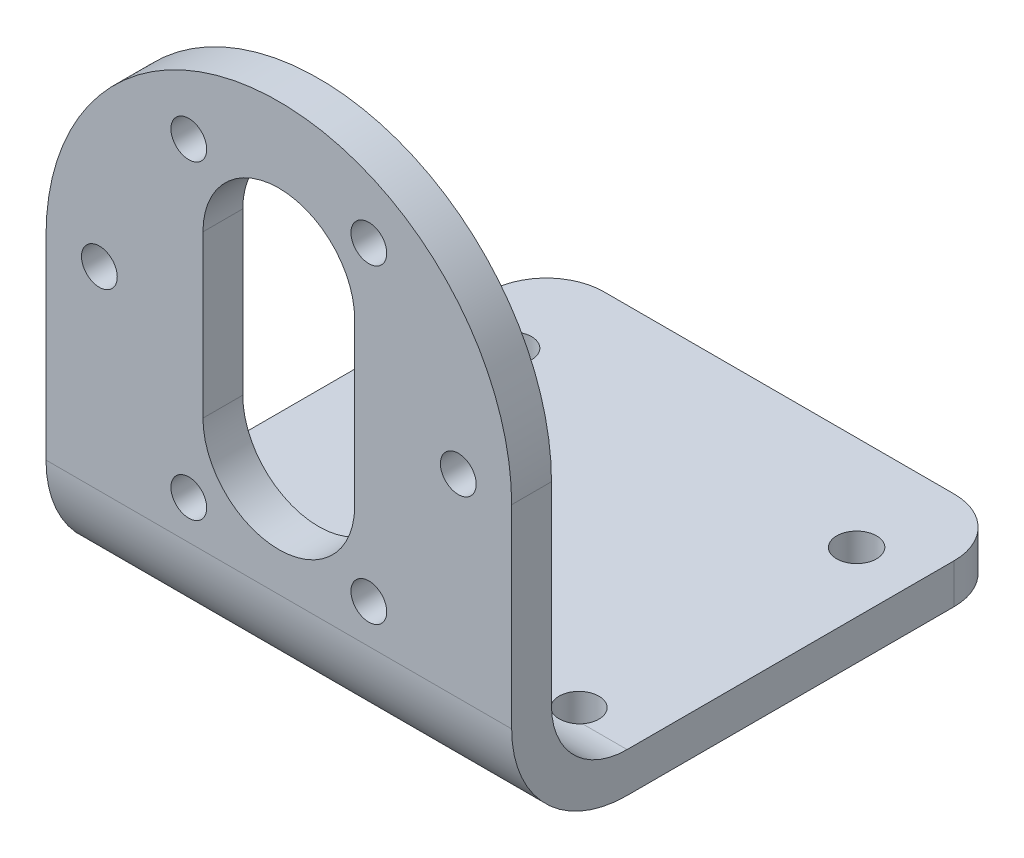
ISO-10303-21;
HEADER;
FILE_DESCRIPTION(('STEP AP214'),'2;1');
FILE_NAME('part.step','',(''),(''),'','','');
FILE_SCHEMA(('AUTOMOTIVE_DESIGN { 1 0 10303 214 1 1 1 1 }'));
ENDSEC;
DATA;
#1=APPLICATION_CONTEXT('core data for automotive mechanical design processes');
#2=APPLICATION_PROTOCOL_DEFINITION('international standard','automotive_design',2000,#1);
#3=PRODUCT_CONTEXT('',#1,'mechanical');
#4=PRODUCT('Part','Part','',(#3));
#5=PRODUCT_RELATED_PRODUCT_CATEGORY('part','',(#4));
#6=PRODUCT_DEFINITION_FORMATION('','',#4);
#7=PRODUCT_DEFINITION_CONTEXT('part definition',#1,'design');
#8=PRODUCT_DEFINITION('design','',#6,#7);
#9=PRODUCT_DEFINITION_SHAPE('','',#8);
#10=(LENGTH_UNIT() NAMED_UNIT(*) SI_UNIT(.MILLI.,.METRE.));
#11=(NAMED_UNIT(*) PLANE_ANGLE_UNIT() SI_UNIT($,.RADIAN.));
#12=(NAMED_UNIT(*) SI_UNIT($,.STERADIAN.) SOLID_ANGLE_UNIT());
#13=UNCERTAINTY_MEASURE_WITH_UNIT(LENGTH_MEASURE(1.E-05),#10,'distance_accuracy_value','');
#14=(GEOMETRIC_REPRESENTATION_CONTEXT(3) GLOBAL_UNCERTAINTY_ASSIGNED_CONTEXT((#13)) GLOBAL_UNIT_ASSIGNED_CONTEXT((#10,
#11,#12)) REPRESENTATION_CONTEXT('',''));
#15=CARTESIAN_POINT('',(0.,0.,0.));
#16=DIRECTION('',(0.,0.,1.));
#17=DIRECTION('',(1.,0.,0.));
#18=AXIS2_PLACEMENT_3D('',#15,#16,#17);
#19=CARTESIAN_POINT('',(-47.1412127925836,47.,50.783023222912));
#20=DIRECTION('',(0.,0.,-1.));
#21=DIRECTION('',(-1.,0.,0.));
#22=AXIS2_PLACEMENT_3D('',#19,#20,#21);
#23=PLANE('',#22);
#24=CARTESIAN_POINT('',(-19.1662127925836,13.3727697016443,50.783023222912));
#25=DIRECTION('',(0.,0.,1.));
#26=DIRECTION('',(1.,0.,0.));
#27=AXIS2_PLACEMENT_3D('',#24,#25,#26);
#28=CIRCLE('',#27,1.55);
#29=CARTESIAN_POINT('',(-17.6162127925836,13.3727697016443,50.783023222912));
#30=VERTEX_POINT('',#29);
#31=EDGE_CURVE('E436',#30,#30,#28,.F.);
#32=ORIENTED_EDGE('',*,*,#31,.T.);
#33=EDGE_LOOP('',(#32));
#34=FACE_BOUND('',#33,.T.);
#35=CARTESIAN_POINT('',(-42.5162127925836,26.825,50.783023222912));
#36=DIRECTION('',(0.,0.,1.));
#37=DIRECTION('',(1.,0.,0.));
#38=AXIS2_PLACEMENT_3D('',#35,#36,#37);
#39=CIRCLE('',#38,1.54999999999999);
#40=CARTESIAN_POINT('',(-40.9662127925836,26.825,50.783023222912));
#41=VERTEX_POINT('',#40);
#42=EDGE_CURVE('E433',#41,#41,#39,.T.);
#43=ORIENTED_EDGE('',*,*,#42,.F.);
#44=EDGE_LOOP('',(#43));
#45=FACE_BOUND('',#44,.T.);
#46=CARTESIAN_POINT('',(-19.1662127925836,40.2772302983557,50.783023222912));
#47=DIRECTION('',(0.,0.,1.));
#48=DIRECTION('',(1.,0.,0.));
#49=AXIS2_PLACEMENT_3D('',#46,#47,#48);
#50=CIRCLE('',#49,1.55);
#51=CARTESIAN_POINT('',(-17.6162127925836,40.2772302983557,50.783023222912));
#52=VERTEX_POINT('',#51);
#53=EDGE_CURVE('E428',#52,#52,#50,.T.);
#54=ORIENTED_EDGE('',*,*,#53,.F.);
#55=EDGE_LOOP('',(#54));
#56=FACE_BOUND('',#55,.T.);
#57=CARTESIAN_POINT('',(-34.7662127925836,13.3727697016443,50.783023222912));
#58=DIRECTION('',(0.,0.,1.));
#59=DIRECTION('',(1.,0.,0.));
#60=AXIS2_PLACEMENT_3D('',#57,#58,#59);
#61=CIRCLE('',#60,1.55);
#62=CARTESIAN_POINT('',(-33.2162127925836,13.3727697016443,50.783023222912));
#63=VERTEX_POINT('',#62);
#64=EDGE_CURVE('E266',#63,#63,#61,.F.);
#65=ORIENTED_EDGE('',*,*,#64,.T.);
#66=EDGE_LOOP('',(#65));
#67=FACE_BOUND('',#66,.T.);
#68=CARTESIAN_POINT('',(-26.9662127925836,19.945,50.783023222912));
#69=DIRECTION('',(0.,0.,1.));
#70=DIRECTION('',(1.,0.,0.));
#71=AXIS2_PLACEMENT_3D('',#68,#69,#70);
#72=CIRCLE('',#71,6.575);
#73=CARTESIAN_POINT('',(-33.5412127925836,19.945,50.783023222912));
#74=VERTEX_POINT('',#73);
#75=CARTESIAN_POINT('',(-20.3912127925836,19.945,50.783023222912));
#76=VERTEX_POINT('',#75);
#77=EDGE_CURVE('E173',#74,#76,#72,.T.);
#78=ORIENTED_EDGE('',*,*,#77,.F.);
#79=DIRECTION('',(0.,-1.,0.));
#80=VECTOR('',#79,1.);
#81=CARTESIAN_POINT('',(-33.5412127925836,0.,50.783023222912));
#82=LINE('',#81,#80);
#83=CARTESIAN_POINT('',(-33.5412127925836,33.925,50.783023222912));
#84=VERTEX_POINT('',#83);
#85=EDGE_CURVE('E51',#84,#74,#82,.T.);
#86=ORIENTED_EDGE('',*,*,#85,.F.);
#87=CARTESIAN_POINT('',(-26.9662127925836,33.925,50.783023222912));
#88=DIRECTION('',(0.,0.,1.));
#89=DIRECTION('',(1.,0.,0.));
#90=AXIS2_PLACEMENT_3D('',#87,#88,#89);
#91=CIRCLE('',#90,6.57500000000001);
#92=CARTESIAN_POINT('',(-20.3912127925836,33.925,50.783023222912));
#93=VERTEX_POINT('',#92);
#94=EDGE_CURVE('E179',#93,#84,#91,.T.);
#95=ORIENTED_EDGE('',*,*,#94,.F.);
#96=DIRECTION('',(0.,-1.,0.));
#97=VECTOR('',#96,1.);
#98=CARTESIAN_POINT('',(-20.3912127925836,0.,50.783023222912));
#99=LINE('',#98,#97);
#100=EDGE_CURVE('E164',#93,#76,#99,.T.);
#101=ORIENTED_EDGE('',*,*,#100,.T.);
#102=EDGE_LOOP('',(#78,#86,#95,#101));
#103=FACE_BOUND('',#102,.T.);
#104=DIRECTION('',(0.,-1.,0.));
#105=VECTOR('',#104,1.);
#106=CARTESIAN_POINT('',(-47.1412127925836,47.,50.783023222912));
#107=LINE('',#106,#105);
#108=CARTESIAN_POINT('',(-47.1412127925836,26.825,50.783023222912));
#109=VERTEX_POINT('',#108);
#110=CARTESIAN_POINT('',(-47.1412127925836,10.,50.783023222912));
#111=VERTEX_POINT('',#110);
#112=EDGE_CURVE('E324',#109,#111,#107,.T.);
#113=ORIENTED_EDGE('',*,*,#112,.T.);
#114=DIRECTION('',(1.,0.,0.));
#115=VECTOR('',#114,1.);
#116=CARTESIAN_POINT('',(-47.1412127925836,10.,50.783023222912));
#117=LINE('',#116,#115);
#118=CARTESIAN_POINT('',(-6.79121279258359,10.,50.783023222912));
#119=VERTEX_POINT('',#118);
#120=EDGE_CURVE('E319',#111,#119,#117,.T.);
#121=ORIENTED_EDGE('',*,*,#120,.T.);
#122=DIRECTION('',(0.,-1.,0.));
#123=VECTOR('',#122,1.);
#124=CARTESIAN_POINT('',(-6.79121279258359,47.,50.783023222912));
#125=LINE('',#124,#123);
#126=CARTESIAN_POINT('',(-6.79121279258359,26.825,50.783023222912));
#127=VERTEX_POINT('',#126);
#128=EDGE_CURVE('E327',#127,#119,#125,.T.);
#129=ORIENTED_EDGE('',*,*,#128,.F.);
#130=CARTESIAN_POINT('',(-26.9662127925836,26.825,50.783023222912));
#131=DIRECTION('',(0.,0.,1.));
#132=DIRECTION('',(1.,0.,0.));
#133=AXIS2_PLACEMENT_3D('',#130,#131,#132);
#134=CIRCLE('',#133,20.175);
#135=EDGE_CURVE('E341',#127,#109,#134,.T.);
#136=ORIENTED_EDGE('',*,*,#135,.T.);
#137=EDGE_LOOP('',(#113,#121,#129,#136));
#138=FACE_BOUND('',#137,.T.);
#139=CARTESIAN_POINT('',(-34.7662127925836,40.2772302983557,50.783023222912));
#140=DIRECTION('',(0.,0.,1.));
#141=DIRECTION('',(1.,0.,0.));
#142=AXIS2_PLACEMENT_3D('',#139,#140,#141);
#143=CIRCLE('',#142,1.55);
#144=CARTESIAN_POINT('',(-33.2162127925836,40.2772302983557,50.783023222912));
#145=VERTEX_POINT('',#144);
#146=EDGE_CURVE('E430',#145,#145,#143,.T.);
#147=ORIENTED_EDGE('',*,*,#146,.F.);
#148=EDGE_LOOP('',(#147));
#149=FACE_BOUND('',#148,.T.);
#150=CARTESIAN_POINT('',(-11.4162127925836,26.825,50.783023222912));
#151=DIRECTION('',(0.,0.,1.));
#152=DIRECTION('',(1.,0.,0.));
#153=AXIS2_PLACEMENT_3D('',#150,#151,#152);
#154=CIRCLE('',#153,1.55);
#155=CARTESIAN_POINT('',(-9.8662127925836,26.825,50.783023222912));
#156=VERTEX_POINT('',#155);
#157=EDGE_CURVE('E439',#156,#156,#154,.T.);
#158=ORIENTED_EDGE('',*,*,#157,.F.);
#159=EDGE_LOOP('',(#158));
#160=FACE_BOUND('',#159,.T.);
#161=ADVANCED_FACE('F34',(#34,#45,#56,#67,#103,#138,#149,#160),#23,.F.);
#162=CARTESIAN_POINT('',(54.8587872074164,0.,47.3330232229119));
#163=DIRECTION('',(0.,0.,1.));
#164=DIRECTION('',(1.,0.,0.));
#165=AXIS2_PLACEMENT_3D('',#162,#163,#164);
#166=PLANE('',#165);
#167=CARTESIAN_POINT('',(-19.1662127925836,13.3727697016443,47.333023222912));
#168=DIRECTION('',(0.,0.,1.));
#169=DIRECTION('',(1.,0.,0.));
#170=AXIS2_PLACEMENT_3D('',#167,#168,#169);
#171=CIRCLE('',#170,1.55);
#172=CARTESIAN_POINT('',(-17.6162127925836,13.3727697016443,47.333023222912));
#173=VERTEX_POINT('',#172);
#174=EDGE_CURVE('E38',#173,#173,#171,.F.);
#175=ORIENTED_EDGE('',*,*,#174,.F.);
#176=EDGE_LOOP('',(#175));
#177=FACE_BOUND('',#176,.T.);
#178=CARTESIAN_POINT('',(-42.5162127925836,26.825,47.333023222912));
#179=DIRECTION('',(0.,0.,1.));
#180=DIRECTION('',(1.,0.,0.));
#181=AXIS2_PLACEMENT_3D('',#178,#179,#180);
#182=CIRCLE('',#181,1.54999999999999);
#183=CARTESIAN_POINT('',(-40.9662127925836,26.825,47.333023222912));
#184=VERTEX_POINT('',#183);
#185=EDGE_CURVE('E239',#184,#184,#182,.T.);
#186=ORIENTED_EDGE('',*,*,#185,.T.);
#187=EDGE_LOOP('',(#186));
#188=FACE_BOUND('',#187,.T.);
#189=CARTESIAN_POINT('',(-19.1662127925836,40.2772302983557,47.333023222912));
#190=DIRECTION('',(0.,0.,1.));
#191=DIRECTION('',(1.,0.,0.));
#192=AXIS2_PLACEMENT_3D('',#189,#190,#191);
#193=CIRCLE('',#192,1.55);
#194=CARTESIAN_POINT('',(-17.6162127925836,40.2772302983557,47.333023222912));
#195=VERTEX_POINT('',#194);
#196=EDGE_CURVE('E243',#195,#195,#193,.T.);
#197=ORIENTED_EDGE('',*,*,#196,.T.);
#198=EDGE_LOOP('',(#197));
#199=FACE_BOUND('',#198,.T.);
#200=CARTESIAN_POINT('',(-34.7662127925836,13.3727697016443,47.333023222912));
#201=DIRECTION('',(0.,0.,1.));
#202=DIRECTION('',(1.,0.,0.));
#203=AXIS2_PLACEMENT_3D('',#200,#201,#202);
#204=CIRCLE('',#203,1.55);
#205=CARTESIAN_POINT('',(-33.2162127925836,13.3727697016443,47.333023222912));
#206=VERTEX_POINT('',#205);
#207=EDGE_CURVE('E247',#206,#206,#204,.F.);
#208=ORIENTED_EDGE('',*,*,#207,.F.);
#209=EDGE_LOOP('',(#208));
#210=FACE_BOUND('',#209,.T.);
#211=CARTESIAN_POINT('',(-26.9662127925836,33.925,47.333023222912));
#212=DIRECTION('',(0.,0.,1.));
#213=DIRECTION('',(1.,0.,0.));
#214=AXIS2_PLACEMENT_3D('',#211,#212,#213);
#215=CIRCLE('',#214,6.57500000000001);
#216=CARTESIAN_POINT('',(-20.3912127925836,33.925,47.333023222912));
#217=VERTEX_POINT('',#216);
#218=CARTESIAN_POINT('',(-33.5412127925836,33.925,47.333023222912));
#219=VERTEX_POINT('',#218);
#220=EDGE_CURVE('E43',#217,#219,#215,.T.);
#221=ORIENTED_EDGE('',*,*,#220,.T.);
#222=DIRECTION('',(0.,-1.,0.));
#223=VECTOR('',#222,1.);
#224=CARTESIAN_POINT('',(-33.5412127925836,0.,47.333023222912));
#225=LINE('',#224,#223);
#226=CARTESIAN_POINT('',(-33.5412127925836,19.945,47.333023222912));
#227=VERTEX_POINT('',#226);
#228=EDGE_CURVE('E11',#219,#227,#225,.T.);
#229=ORIENTED_EDGE('',*,*,#228,.T.);
#230=CARTESIAN_POINT('',(-26.9662127925836,19.945,47.333023222912));
#231=DIRECTION('',(0.,0.,1.));
#232=DIRECTION('',(1.,0.,0.));
#233=AXIS2_PLACEMENT_3D('',#230,#231,#232);
#234=CIRCLE('',#233,6.575);
#235=CARTESIAN_POINT('',(-20.3912127925836,19.945,47.333023222912));
#236=VERTEX_POINT('',#235);
#237=EDGE_CURVE('E270',#227,#236,#234,.T.);
#238=ORIENTED_EDGE('',*,*,#237,.T.);
#239=DIRECTION('',(0.,-1.,0.));
#240=VECTOR('',#239,1.);
#241=CARTESIAN_POINT('',(-20.3912127925836,0.,47.333023222912));
#242=LINE('',#241,#240);
#243=EDGE_CURVE('E167',#217,#236,#242,.T.);
#244=ORIENTED_EDGE('',*,*,#243,.F.);
#245=EDGE_LOOP('',(#221,#229,#238,#244));
#246=FACE_BOUND('',#245,.T.);
#247=DIRECTION('',(-1.,0.,0.));
#248=VECTOR('',#247,1.);
#249=CARTESIAN_POINT('',(54.8587872074164,10.,47.3330232229119));
#250=LINE('',#249,#248);
#251=CARTESIAN_POINT('',(-6.79121279258359,10.,47.333023222912));
#252=VERTEX_POINT('',#251);
#253=CARTESIAN_POINT('',(-47.1412127925836,10.,47.333023222912));
#254=VERTEX_POINT('',#253);
#255=EDGE_CURVE('E252',#252,#254,#250,.T.);
#256=ORIENTED_EDGE('',*,*,#255,.T.);
#257=DIRECTION('',(0.,1.,0.));
#258=VECTOR('',#257,1.);
#259=CARTESIAN_POINT('',(-47.1412127925836,0.,47.333023222912));
#260=LINE('',#259,#258);
#261=CARTESIAN_POINT('',(-47.1412127925836,26.825,47.333023222912));
#262=VERTEX_POINT('',#261);
#263=EDGE_CURVE('E359',#254,#262,#260,.T.);
#264=ORIENTED_EDGE('',*,*,#263,.T.);
#265=CARTESIAN_POINT('',(-26.9662127925836,26.825,47.333023222912));
#266=DIRECTION('',(0.,0.,1.));
#267=DIRECTION('',(1.,0.,0.));
#268=AXIS2_PLACEMENT_3D('',#265,#266,#267);
#269=CIRCLE('',#268,20.175);
#270=CARTESIAN_POINT('',(-6.79121279258359,26.825,47.333023222912));
#271=VERTEX_POINT('',#270);
#272=EDGE_CURVE('E308',#262,#271,#269,.F.);
#273=ORIENTED_EDGE('',*,*,#272,.T.);
#274=DIRECTION('',(0.,1.,0.));
#275=VECTOR('',#274,1.);
#276=CARTESIAN_POINT('',(-6.7912127925836,47.,47.333023222912));
#277=LINE('',#276,#275);
#278=EDGE_CURVE('E347',#252,#271,#277,.T.);
#279=ORIENTED_EDGE('',*,*,#278,.F.);
#280=EDGE_LOOP('',(#256,#264,#273,#279));
#281=FACE_BOUND('',#280,.T.);
#282=CARTESIAN_POINT('',(-34.7662127925836,40.2772302983557,47.333023222912));
#283=DIRECTION('',(0.,0.,1.));
#284=DIRECTION('',(1.,0.,0.));
#285=AXIS2_PLACEMENT_3D('',#282,#283,#284);
#286=CIRCLE('',#285,1.55);
#287=CARTESIAN_POINT('',(-33.2162127925836,40.2772302983557,47.333023222912));
#288=VERTEX_POINT('',#287);
#289=EDGE_CURVE('E257',#288,#288,#286,.T.);
#290=ORIENTED_EDGE('',*,*,#289,.T.);
#291=EDGE_LOOP('',(#290));
#292=FACE_BOUND('',#291,.T.);
#293=CARTESIAN_POINT('',(-11.4162127925836,26.825,47.333023222912));
#294=DIRECTION('',(0.,0.,1.));
#295=DIRECTION('',(1.,0.,0.));
#296=AXIS2_PLACEMENT_3D('',#293,#294,#295);
#297=CIRCLE('',#296,1.55);
#298=CARTESIAN_POINT('',(-9.8662127925836,26.825,47.333023222912));
#299=VERTEX_POINT('',#298);
#300=EDGE_CURVE('E260',#299,#299,#297,.T.);
#301=ORIENTED_EDGE('',*,*,#300,.T.);
#302=EDGE_LOOP('',(#301));
#303=FACE_BOUND('',#302,.T.);
#304=ADVANCED_FACE('F222',(#177,#188,#199,#210,#246,#281,#292,#303),#166,.F.);
#305=CARTESIAN_POINT('',(-47.1412127925836,10.,40.783023222912));
#306=DIRECTION('',(1.,0.,0.));
#307=DIRECTION('',(0.,0.,-1.));
#308=AXIS2_PLACEMENT_3D('',#305,#306,#307);
#309=CYLINDRICAL_SURFACE('',#308,10.);
#310=DIRECTION('',(1.,0.,0.));
#311=VECTOR('',#310,1.);
#312=CARTESIAN_POINT('',(0.,0.,40.783023222912));
#313=LINE('',#312,#311);
#314=CARTESIAN_POINT('',(-43.2784362563963,0.,40.783023222912));
#315=VERTEX_POINT('',#314);
#316=CARTESIAN_POINT('',(-47.1412127925836,0.,40.783023222912));
#317=VERTEX_POINT('',#316);
#318=EDGE_CURVE('E316',#315,#317,#313,.F.);
#319=ORIENTED_EDGE('',*,*,#318,.F.);
#320=CARTESIAN_POINT('',(-43.2784362563963,0.,40.783023222912));
#321=CARTESIAN_POINT('',(-43.2486359399709,-4.4349836473621E-07,40.8214603242163));
#322=CARTESIAN_POINT('',(-43.2172287872784,0.000221662332903279,40.8586212397988));
#323=CARTESIAN_POINT('',(-43.1514043101819,0.0010186956629008,40.9301644796071));
#324=CARTESIAN_POINT('',(-43.1169872222953,0.00159359546079015,40.9645470217466));
#325=CARTESIAN_POINT('',(-43.0096338534374,0.00370689110784972,41.0630910128974));
#326=CARTESIAN_POINT('',(-42.9324984911893,0.0056344754400285,41.1227736432645));
#327=CARTESIAN_POINT('',(-42.7693296609276,0.00977993356184888,41.228345263273));
#328=CARTESIAN_POINT('',(-42.6832930344563,0.0119979104668324,41.2742293340198));
#329=CARTESIAN_POINT('',(-42.5047417406216,0.0160643864272017,41.3509225745123));
#330=CARTESIAN_POINT('',(-42.4122283105362,0.017912955792662,41.3817346145671));
#331=CARTESIAN_POINT('',(-42.2232265987625,0.0207581801391745,41.4274329016619));
#332=CARTESIAN_POINT('',(-42.12673395157,0.0217538719032161,41.4423011469684));
#333=CARTESIAN_POINT('',(-41.9326057116994,0.0226429764720122,41.4556247462691));
#334=CARTESIAN_POINT('',(-41.8349700052027,0.0225362785590523,41.4540784516805));
#335=CARTESIAN_POINT('',(-41.6415763854825,0.021247958445125,41.4346366721685));
#336=CARTESIAN_POINT('',(-41.545814678288,0.0200688027684255,41.4167787017401));
#337=CARTESIAN_POINT('',(-41.3586275956189,0.0169319205563948,41.3652693387677));
#338=CARTESIAN_POINT('',(-41.2672030897992,0.0149740386105347,41.3316147934571));
#339=CARTESIAN_POINT('',(-41.0911541003926,0.0107972095030289,41.24941231941));
#340=CARTESIAN_POINT('',(-41.0065411024623,0.0085778363148311,41.2008398734209));
#341=CARTESIAN_POINT('',(-40.8467183970987,0.00456685197800229,41.0901995387781));
#342=CARTESIAN_POINT('',(-40.7714972938275,0.0027747199777472,41.0281482605263));
#343=CARTESIAN_POINT('',(-40.6737041799865,0.00108006920567029,40.9325906426761));
#344=CARTESIAN_POINT('',(-40.6463021380582,0.000686824269006335,40.9039027447807));
#345=CARTESIAN_POINT('',(-40.5935784639084,0.000146949433395791,40.8447642573952));
#346=CARTESIAN_POINT('',(-40.5682532244093,-1.17077590246397E-07,40.8143168878988));
#347=CARTESIAN_POINT('',(-40.5439893287709,0.,40.783023222912));
#348=B_SPLINE_CURVE_WITH_KNOTS('',3,(#320,#321,#322,#323,#324,#325,#326,#327,#328,#329,#330,
#331,#332,#333,#334,#335,#336,#337,#338,#339,#340,#341,#342,#343,#344,#345,#346,#347),
.UNSPECIFIED.,.F.,.F.,(4,2,2,2,2,2,2,2,2,2,2,2,2,4),(0.,0.145817200628919,0.291622953380003,
0.5827663273497,0.874013365077776,1.1652049162671,1.45672489938087,1.74827416137905,
2.03915458593045,2.33009309068699,2.62151232879096,2.91257445855667,3.03152037022583,
3.1502550998775),.UNSPECIFIED.);
#349=CARTESIAN_POINT('',(-40.5439893287709,0.,40.783023222912));
#350=VERTEX_POINT('',#349);
#351=EDGE_CURVE('E365',#315,#350,#348,.T.);
#352=ORIENTED_EDGE('',*,*,#351,.T.);
#353=CARTESIAN_POINT('',(-13.3884362563963,0.,40.783023222912));
#354=VERTEX_POINT('',#353);
#355=EDGE_CURVE('E315',#354,#350,#313,.F.);
#356=ORIENTED_EDGE('',*,*,#355,.F.);
#357=CARTESIAN_POINT('',(-13.3884362563963,0.,40.783023222912));
#358=CARTESIAN_POINT('',(-13.3586359399709,-4.43498364004496E-07,40.8214603242163));
#359=CARTESIAN_POINT('',(-13.3272287872784,0.000221662332904452,40.8586212397988));
#360=CARTESIAN_POINT('',(-13.261404310182,0.0010186956629024,40.9301644796071));
#361=CARTESIAN_POINT('',(-13.2269872222954,0.00159359546079172,40.9645470217466));
#362=CARTESIAN_POINT('',(-13.1196338534375,0.00370689110785085,41.0630910128974));
#363=CARTESIAN_POINT('',(-13.0424984911893,0.00563447544002885,41.1227736432645));
#364=CARTESIAN_POINT('',(-12.8793296609276,0.00977993356184872,41.228345263273));
#365=CARTESIAN_POINT('',(-12.7932930344563,0.0119979104668325,41.2742293340198));
#366=CARTESIAN_POINT('',(-12.6147417406216,0.016064386427203,41.3509225745122));
#367=CARTESIAN_POINT('',(-12.5222283105362,0.0179129557926641,41.3817346145671));
#368=CARTESIAN_POINT('',(-12.3332265987625,0.0207581801391763,41.4274329016619));
#369=CARTESIAN_POINT('',(-12.23673395157,0.0217538719032167,41.4423011469684));
#370=CARTESIAN_POINT('',(-12.0426057116995,0.0226429764720127,41.4556247462691));
#371=CARTESIAN_POINT('',(-11.9449700052027,0.022536278559054,41.4540784516805));
#372=CARTESIAN_POINT('',(-11.7515763854825,0.0212479584451273,41.4346366721685));
#373=CARTESIAN_POINT('',(-11.655814678288,0.0200688027684272,41.4167787017401));
#374=CARTESIAN_POINT('',(-11.4686275956189,0.0169319205563954,41.3652693387677));
#375=CARTESIAN_POINT('',(-11.3772030897992,0.0149740386105346,41.3316147934571));
#376=CARTESIAN_POINT('',(-11.2011541003926,0.0107972095030294,41.24941231941));
#377=CARTESIAN_POINT('',(-11.1165411024623,0.00857783631483298,41.2008398734209));
#378=CARTESIAN_POINT('',(-10.9567183970987,0.00456685197800412,41.0901995387781));
#379=CARTESIAN_POINT('',(-10.8814972938275,0.00277471997774761,41.0281482605263));
#380=CARTESIAN_POINT('',(-10.7837041799865,0.00108006920567024,40.9325906426761));
#381=CARTESIAN_POINT('',(-10.7563021380582,0.00068682426900633,40.9039027447807));
#382=CARTESIAN_POINT('',(-10.7035784639084,0.000146949433395858,40.8447642573952));
#383=CARTESIAN_POINT('',(-10.6782532244093,-1.17077590163831E-07,40.8143168878988));
#384=CARTESIAN_POINT('',(-10.6539893287709,0.,40.783023222912));
#385=B_SPLINE_CURVE_WITH_KNOTS('',3,(#357,#358,#359,#360,#361,#362,#363,#364,#365,#366,#367,
#368,#369,#370,#371,#372,#373,#374,#375,#376,#377,#378,#379,#380,#381,#382,#383,#384),
.UNSPECIFIED.,.F.,.F.,(4,2,2,2,2,2,2,2,2,2,2,2,2,4),(0.,0.145817200628917,0.29162295337999,
0.582766327349691,0.874013365077768,1.16520491626709,1.45672489938085,1.74827416137904,
2.03915458593043,2.33009309068698,2.62151232879094,2.91257445855666,3.03152037022582,
3.1502550998775),.UNSPECIFIED.);
#386=CARTESIAN_POINT('',(-10.6539893287709,0.,40.783023222912));
#387=VERTEX_POINT('',#386);
#388=EDGE_CURVE('E196',#354,#387,#385,.T.);
#389=ORIENTED_EDGE('',*,*,#388,.T.);
#390=CARTESIAN_POINT('',(-6.7912127925836,0.,40.783023222912));
#391=VERTEX_POINT('',#390);
#392=EDGE_CURVE('E312',#391,#387,#313,.F.);
#393=ORIENTED_EDGE('',*,*,#392,.F.);
#394=CARTESIAN_POINT('',(-6.79121279258359,10.,40.783023222912));
#395=DIRECTION('',(-1.,0.,0.));
#396=DIRECTION('',(0.,0.,1.));
#397=AXIS2_PLACEMENT_3D('',#394,#395,#396);
#398=CIRCLE('',#397,10.);
#399=EDGE_CURVE('E317',#119,#391,#398,.F.);
#400=ORIENTED_EDGE('',*,*,#399,.F.);
#401=ORIENTED_EDGE('',*,*,#120,.F.);
#402=CARTESIAN_POINT('',(-47.1412127925836,10.,40.783023222912));
#403=DIRECTION('',(1.,0.,0.));
#404=DIRECTION('',(0.,0.,-1.));
#405=AXIS2_PLACEMENT_3D('',#402,#403,#404);
#406=CIRCLE('',#405,10.);
#407=EDGE_CURVE('E310',#317,#111,#406,.F.);
#408=ORIENTED_EDGE('',*,*,#407,.F.);
#409=EDGE_LOOP('',(#319,#352,#356,#389,#393,#400,#401,#408));
#410=FACE_BOUND('',#409,.T.);
#411=ADVANCED_FACE('F224',(#410),#309,.T.);
#412=CARTESIAN_POINT('',(54.8587872074164,10.,40.783023222912));
#413=DIRECTION('',(-1.,0.,0.));
#414=DIRECTION('',(0.,0.,1.));
#415=AXIS2_PLACEMENT_3D('',#412,#413,#414);
#416=CYLINDRICAL_SURFACE('',#415,6.55);
#417=CARTESIAN_POINT('',(-43.2784362563963,3.45,40.783023222912));
#418=CARTESIAN_POINT('',(-43.2486649030444,3.44999934867349,40.8214232101327));
#419=CARTESIAN_POINT('',(-43.2172902209575,3.45033775649313,40.8585485309627));
#420=CARTESIAN_POINT('',(-43.1515404880796,3.45155234711172,40.9300223959799));
#421=CARTESIAN_POINT('',(-43.1171657950523,3.4524284658614,40.9643712703312));
#422=CARTESIAN_POINT('',(-43.0099569119221,3.4556495514347,41.0628179147159));
#423=CARTESIAN_POINT('',(-42.9329391434865,3.45858816576504,41.1224428225017));
#424=CARTESIAN_POINT('',(-42.7700443143619,3.46491250386588,41.2279283458496));
#425=CARTESIAN_POINT('',(-42.6841653050849,3.46829832602347,41.2737859252697));
#426=CARTESIAN_POINT('',(-42.5059278443798,3.47451325501785,41.3504810031661));
#427=CARTESIAN_POINT('',(-42.4135705615224,3.47734246191005,41.3813212025926));
#428=CARTESIAN_POINT('',(-42.2247208263061,3.48170828002287,41.4271593411075));
#429=CARTESIAN_POINT('',(-42.1282182748401,3.48324152138179,41.4421160044016));
#430=CARTESIAN_POINT('',(-41.9340504787137,3.48461989976377,41.4556076068657));
#431=CARTESIAN_POINT('',(-41.8363851496024,3.48446491341682,41.4541413459035));
#432=CARTESIAN_POINT('',(-41.6432092488083,3.48251007467015,41.4348786711695));
#433=CARTESIAN_POINT('',(-41.5476901567274,3.48071871713345,41.4171665920683));
#434=CARTESIAN_POINT('',(-41.360958528036,3.47594847703818,41.3660360946161));
#435=CARTESIAN_POINT('',(-41.2697470123892,3.47296931451527,41.3326139730928));
#436=CARTESIAN_POINT('',(-41.0939340886157,3.4666029712209,41.2508939730243));
#437=CARTESIAN_POINT('',(-41.0093543826965,3.46321453608974,41.2025496178487));
#438=CARTESIAN_POINT('',(-40.8495367810102,3.45707866045226,41.0923795263331));
#439=CARTESIAN_POINT('',(-40.7742873177906,3.45433042244906,41.0305707505484));
#440=CARTESIAN_POINT('',(-40.6759167088539,3.45169993130762,40.9348709782518));
#441=CARTESIAN_POINT('',(-40.6480286032222,3.45108135877871,40.9057707295625));
#442=CARTESIAN_POINT('',(-40.5943938538111,3.45023162529874,40.8457439712088));
#443=CARTESIAN_POINT('',(-40.5686436235682,3.44999980253179,40.814820675295));
#444=CARTESIAN_POINT('',(-40.5439893287709,3.45,40.783023222912));
#445=B_SPLINE_CURVE_WITH_KNOTS('',3,(#417,#418,#419,#420,#421,#422,#423,#424,#425,#426,#427,
#428,#429,#430,#431,#432,#433,#434,#435,#436,#437,#438,#439,#440,#441,#442,#443,#444),
.UNSPECIFIED.,.F.,.F.,(4,2,2,2,2,2,2,2,2,2,2,2,2,4),(0.,0.145674126204746,0.291330903847856,
0.582167706488014,0.873068601032213,1.16391715626718,1.45551969013826,1.74714353348516,
2.03726202612376,2.32744893983427,2.61854894557612,2.90928436386592,3.03013527599317,
3.15077917208322),.UNSPECIFIED.);
#446=CARTESIAN_POINT('',(-43.2784362563963,3.44999999999999,40.783023222912));
#447=VERTEX_POINT('',#446);
#448=CARTESIAN_POINT('',(-40.5439893287709,3.44999999999999,40.783023222912));
#449=VERTEX_POINT('',#448);
#450=EDGE_CURVE('E372',#447,#449,#445,.T.);
#451=ORIENTED_EDGE('',*,*,#450,.F.);
#452=DIRECTION('',(-1.,0.,0.));
#453=VECTOR('',#452,1.);
#454=CARTESIAN_POINT('',(54.8587872074164,3.45,40.783023222912));
#455=LINE('',#454,#453);
#456=CARTESIAN_POINT('',(-47.1412127925836,3.45,40.783023222912));
#457=VERTEX_POINT('',#456);
#458=EDGE_CURVE('E352',#447,#457,#455,.T.);
#459=ORIENTED_EDGE('',*,*,#458,.T.);
#460=CARTESIAN_POINT('',(-47.1412127925836,10.,40.783023222912));
#461=DIRECTION('',(-1.,0.,0.));
#462=DIRECTION('',(0.,0.,1.));
#463=AXIS2_PLACEMENT_3D('',#460,#461,#462);
#464=CIRCLE('',#463,6.55);
#465=EDGE_CURVE('E361',#457,#254,#464,.T.);
#466=ORIENTED_EDGE('',*,*,#465,.T.);
#467=ORIENTED_EDGE('',*,*,#255,.F.);
#468=CARTESIAN_POINT('',(-6.79121279258359,10.,40.783023222912));
#469=DIRECTION('',(-1.,0.,0.));
#470=DIRECTION('',(0.,0.,1.));
#471=AXIS2_PLACEMENT_3D('',#468,#469,#470);
#472=CIRCLE('',#471,6.55);
#473=CARTESIAN_POINT('',(-6.7912127925836,3.45,40.783023222912));
#474=VERTEX_POINT('',#473);
#475=EDGE_CURVE('E305',#474,#252,#472,.T.);
#476=ORIENTED_EDGE('',*,*,#475,.F.);
#477=CARTESIAN_POINT('',(-10.6539893287709,3.44999999999999,40.783023222912));
#478=VERTEX_POINT('',#477);
#479=EDGE_CURVE('E350',#474,#478,#455,.T.);
#480=ORIENTED_EDGE('',*,*,#479,.T.);
#481=CARTESIAN_POINT('',(-13.3884362563963,3.45,40.783023222912));
#482=CARTESIAN_POINT('',(-13.3586649030444,3.44999934867349,40.8214232101327));
#483=CARTESIAN_POINT('',(-13.3272902209575,3.45033775649313,40.8585485309627));
#484=CARTESIAN_POINT('',(-13.2615404880797,3.45155234711172,40.9300223959798));
#485=CARTESIAN_POINT('',(-13.2271657950523,3.4524284658614,40.9643712703311));
#486=CARTESIAN_POINT('',(-13.1199569119221,3.4556495514347,41.0628179147159));
#487=CARTESIAN_POINT('',(-13.0429391434865,3.45858816576504,41.1224428225017));
#488=CARTESIAN_POINT('',(-12.8800443143619,3.46491250386588,41.2279283458496));
#489=CARTESIAN_POINT('',(-12.7941653050849,3.46829832602347,41.2737859252697));
#490=CARTESIAN_POINT('',(-12.6159278443798,3.47451325501785,41.3504810031661));
#491=CARTESIAN_POINT('',(-12.5235705615224,3.47734246191005,41.3813212025926));
#492=CARTESIAN_POINT('',(-12.3347208263061,3.48170828002287,41.4271593411075));
#493=CARTESIAN_POINT('',(-12.2382182748401,3.48324152138179,41.4421160044016));
#494=CARTESIAN_POINT('',(-12.0440504787137,3.48461989976377,41.4556076068657));
#495=CARTESIAN_POINT('',(-11.9463851496024,3.48446491341683,41.4541413459035));
#496=CARTESIAN_POINT('',(-11.7532092488083,3.48251007467015,41.4348786711695));
#497=CARTESIAN_POINT('',(-11.6576901567275,3.48071871713346,41.4171665920683));
#498=CARTESIAN_POINT('',(-11.470958528036,3.47594847703818,41.3660360946161));
#499=CARTESIAN_POINT('',(-11.3797470123892,3.47296931451527,41.3326139730928));
#500=CARTESIAN_POINT('',(-11.2039340886157,3.4666029712209,41.2508939730243));
#501=CARTESIAN_POINT('',(-11.1193543826966,3.46321453608974,41.2025496178487));
#502=CARTESIAN_POINT('',(-10.9595367810102,3.45707866045226,41.0923795263331));
#503=CARTESIAN_POINT('',(-10.8842873177906,3.45433042244906,41.0305707505484));
#504=CARTESIAN_POINT('',(-10.7859167088539,3.45169993130762,40.9348709782518));
#505=CARTESIAN_POINT('',(-10.7580286032222,3.45108135877871,40.9057707295625));
#506=CARTESIAN_POINT('',(-10.7043938538111,3.45023162529874,40.8457439712088));
#507=CARTESIAN_POINT('',(-10.6786436235682,3.44999980253179,40.814820675295));
#508=CARTESIAN_POINT('',(-10.6539893287709,3.45,40.783023222912));
#509=B_SPLINE_CURVE_WITH_KNOTS('',3,(#481,#482,#483,#484,#485,#486,#487,#488,#489,#490,#491,
#492,#493,#494,#495,#496,#497,#498,#499,#500,#501,#502,#503,#504,#505,#506,#507,#508),
.UNSPECIFIED.,.F.,.F.,(4,2,2,2,2,2,2,2,2,2,2,2,2,4),(0.,0.145674126204736,0.291330903847846,
0.58216770648801,0.8730686010322,1.16391715626717,1.45551969013825,1.74714353348516,
2.03726202612376,2.32744893983427,2.61854894557612,2.90928436386591,3.03013527599317,
3.15077917208322),.UNSPECIFIED.);
#510=CARTESIAN_POINT('',(-13.3884362563963,3.44999999999999,40.783023222912));
#511=VERTEX_POINT('',#510);
#512=EDGE_CURVE('E186',#511,#478,#509,.T.);
#513=ORIENTED_EDGE('',*,*,#512,.F.);
#514=EDGE_CURVE('E356',#511,#449,#455,.T.);
#515=ORIENTED_EDGE('',*,*,#514,.T.);
#516=EDGE_LOOP('',(#451,#459,#466,#467,#476,#480,#513,#515));
#517=FACE_BOUND('',#516,.T.);
#518=ADVANCED_FACE('F203',(#517),#416,.F.);
#519=CARTESIAN_POINT('',(-47.1412127925836,47.,7.43302322291196));
#520=DIRECTION('',(0.,0.,1.));
#521=DIRECTION('',(1.,0.,0.));
#522=AXIS2_PLACEMENT_3D('',#519,#520,#521);
#523=PLANE('',#522);
#524=DIRECTION('',(1.,0.,0.));
#525=VECTOR('',#524,1.);
#526=CARTESIAN_POINT('',(-47.1412127925836,3.45,7.43302322291196));
#527=LINE('',#526,#525);
#528=CARTESIAN_POINT('',(-42.1412127925836,3.45,7.43302322291196));
#529=VERTEX_POINT('',#528);
#530=CARTESIAN_POINT('',(-11.7912127925836,3.45,7.43302322291196));
#531=VERTEX_POINT('',#530);
#532=EDGE_CURVE('E344',#529,#531,#527,.T.);
#533=ORIENTED_EDGE('',*,*,#532,.T.);
#534=DIRECTION('',(0.,-1.,0.));
#535=VECTOR('',#534,1.);
#536=CARTESIAN_POINT('',(-11.7912127925836,47.,7.43302322291196));
#537=LINE('',#536,#535);
#538=CARTESIAN_POINT('',(-11.7912127925836,0.,7.43302322291196));
#539=VERTEX_POINT('',#538);
#540=EDGE_CURVE('E298',#531,#539,#537,.T.);
#541=ORIENTED_EDGE('',*,*,#540,.T.);
#542=DIRECTION('',(-1.,0.,0.));
#543=VECTOR('',#542,1.);
#544=CARTESIAN_POINT('',(-47.1412127925836,0.,7.43302322291196));
#545=LINE('',#544,#543);
#546=CARTESIAN_POINT('',(-42.1412127925836,0.,7.43302322291196));
#547=VERTEX_POINT('',#546);
#548=EDGE_CURVE('E330',#539,#547,#545,.T.);
#549=ORIENTED_EDGE('',*,*,#548,.T.);
#550=DIRECTION('',(0.,-1.,0.));
#551=VECTOR('',#550,1.);
#552=CARTESIAN_POINT('',(-42.1412127925836,47.,7.43302322291196));
#553=LINE('',#552,#551);
#554=EDGE_CURVE('E301',#547,#529,#553,.F.);
#555=ORIENTED_EDGE('',*,*,#554,.T.);
#556=EDGE_LOOP('',(#533,#541,#549,#555));
#557=FACE_BOUND('',#556,.T.);
#558=ADVANCED_FACE('F559',(#557),#523,.F.);
#559=CARTESIAN_POINT('',(-47.1412127925836,47.,7.43302322291196));
#560=DIRECTION('',(1.,0.,0.));
#561=DIRECTION('',(0.,0.,-1.));
#562=AXIS2_PLACEMENT_3D('',#559,#560,#561);
#563=PLANE('',#562);
#564=DIRECTION('',(0.,0.,1.));
#565=VECTOR('',#564,1.);
#566=CARTESIAN_POINT('',(-47.1412127925836,3.45,0.));
#567=LINE('',#566,#565);
#568=CARTESIAN_POINT('',(-47.1412127925836,3.45,12.433023222912));
#569=VERTEX_POINT('',#568);
#570=EDGE_CURVE('E353',#569,#457,#567,.T.);
#571=ORIENTED_EDGE('',*,*,#570,.F.);
#572=DIRECTION('',(0.,-1.,0.));
#573=VECTOR('',#572,1.);
#574=CARTESIAN_POINT('',(-47.1412127925836,47.,12.433023222912));
#575=LINE('',#574,#573);
#576=CARTESIAN_POINT('',(-47.1412127925836,0.,12.433023222912));
#577=VERTEX_POINT('',#576);
#578=EDGE_CURVE('E285',#569,#577,#575,.T.);
#579=ORIENTED_EDGE('',*,*,#578,.T.);
#580=DIRECTION('',(0.,0.,1.));
#581=VECTOR('',#580,1.);
#582=CARTESIAN_POINT('',(-47.1412127925836,0.,7.43302322291196));
#583=LINE('',#582,#581);
#584=EDGE_CURVE('E336',#577,#317,#583,.T.);
#585=ORIENTED_EDGE('',*,*,#584,.T.);
#586=ORIENTED_EDGE('',*,*,#407,.T.);
#587=ORIENTED_EDGE('',*,*,#112,.F.);
#588=DIRECTION('',(0.,0.,1.));
#589=VECTOR('',#588,1.);
#590=CARTESIAN_POINT('',(-47.1412127925836,26.825,-51.216976777088));
#591=LINE('',#590,#589);
#592=EDGE_CURVE('E339',#262,#109,#591,.T.);
#593=ORIENTED_EDGE('',*,*,#592,.F.);
#594=ORIENTED_EDGE('',*,*,#263,.F.);
#595=ORIENTED_EDGE('',*,*,#465,.F.);
#596=EDGE_LOOP('',(#571,#579,#585,#586,#587,#593,#594,#595));
#597=FACE_BOUND('',#596,.T.);
#598=ADVANCED_FACE('F613',(#597),#563,.F.);
#599=CARTESIAN_POINT('',(-6.7912127925836,47.,7.43302322291196));
#600=DIRECTION('',(-1.,0.,0.));
#601=DIRECTION('',(0.,0.,1.));
#602=AXIS2_PLACEMENT_3D('',#599,#600,#601);
#603=PLANE('',#602);
#604=DIRECTION('',(0.,0.,-1.));
#605=VECTOR('',#604,1.);
#606=CARTESIAN_POINT('',(-6.7912127925836,0.,7.43302322291196));
#607=LINE('',#606,#605);
#608=CARTESIAN_POINT('',(-6.7912127925836,0.,12.433023222912));
#609=VERTEX_POINT('',#608);
#610=EDGE_CURVE('E333',#391,#609,#607,.T.);
#611=ORIENTED_EDGE('',*,*,#610,.T.);
#612=DIRECTION('',(0.,-1.,0.));
#613=VECTOR('',#612,1.);
#614=CARTESIAN_POINT('',(-6.7912127925836,47.,12.433023222912));
#615=LINE('',#614,#613);
#616=CARTESIAN_POINT('',(-6.7912127925836,3.45,12.433023222912));
#617=VERTEX_POINT('',#616);
#618=EDGE_CURVE('E292',#609,#617,#615,.F.);
#619=ORIENTED_EDGE('',*,*,#618,.T.);
#620=DIRECTION('',(0.,0.,1.));
#621=VECTOR('',#620,1.);
#622=CARTESIAN_POINT('',(-6.7912127925836,3.45,7.43302322291196));
#623=LINE('',#622,#621);
#624=EDGE_CURVE('E303',#617,#474,#623,.T.);
#625=ORIENTED_EDGE('',*,*,#624,.T.);
#626=ORIENTED_EDGE('',*,*,#475,.T.);
#627=ORIENTED_EDGE('',*,*,#278,.T.);
#628=DIRECTION('',(0.,0.,1.));
#629=VECTOR('',#628,1.);
#630=CARTESIAN_POINT('',(-6.7912127925836,26.825,-51.216976777088));
#631=LINE('',#630,#629);
#632=EDGE_CURVE('E322',#271,#127,#631,.T.);
#633=ORIENTED_EDGE('',*,*,#632,.T.);
#634=ORIENTED_EDGE('',*,*,#128,.T.);
#635=ORIENTED_EDGE('',*,*,#399,.T.);
#636=EDGE_LOOP('',(#611,#619,#625,#626,#627,#633,#634,#635));
#637=FACE_BOUND('',#636,.T.);
#638=ADVANCED_FACE('F590',(#637),#603,.F.);
#639=CARTESIAN_POINT('',(0.,0.,0.));
#640=DIRECTION('',(0.,1.,0.));
#641=DIRECTION('',(0.,0.,1.));
#642=AXIS2_PLACEMENT_3D('',#639,#640,#641);
#643=PLANE('',#642);
#644=CARTESIAN_POINT('',(-41.9112127925836,0.,39.723023222912));
#645=DIRECTION('',(0.,1.,0.));
#646=DIRECTION('',(0.,0.,1.));
#647=AXIS2_PLACEMENT_3D('',#644,#645,#646);
#648=CIRCLE('',#647,1.73);
#649=EDGE_CURVE('E363',#315,#350,#648,.F.);
#650=ORIENTED_EDGE('',*,*,#649,.F.);
#651=ORIENTED_EDGE('',*,*,#318,.T.);
#652=ORIENTED_EDGE('',*,*,#584,.F.);
#653=CARTESIAN_POINT('',(-42.1412127925836,0.,12.433023222912));
#654=DIRECTION('',(0.,1.,0.));
#655=DIRECTION('',(0.,0.,1.));
#656=AXIS2_PLACEMENT_3D('',#653,#654,#655);
#657=CIRCLE('',#656,5.);
#658=EDGE_CURVE('E296',#577,#547,#657,.F.);
#659=ORIENTED_EDGE('',*,*,#658,.T.);
#660=ORIENTED_EDGE('',*,*,#548,.F.);
#661=CARTESIAN_POINT('',(-11.7912127925836,0.,12.433023222912));
#662=DIRECTION('',(0.,1.,0.));
#663=DIRECTION('',(0.,0.,1.));
#664=AXIS2_PLACEMENT_3D('',#661,#662,#663);
#665=CIRCLE('',#664,5.);
#666=EDGE_CURVE('E294',#539,#609,#665,.F.);
#667=ORIENTED_EDGE('',*,*,#666,.T.);
#668=ORIENTED_EDGE('',*,*,#610,.F.);
#669=ORIENTED_EDGE('',*,*,#392,.T.);
#670=CARTESIAN_POINT('',(-12.0212127925836,0.,39.723023222912));
#671=DIRECTION('',(0.,1.,0.));
#672=DIRECTION('',(0.,0.,1.));
#673=AXIS2_PLACEMENT_3D('',#670,#671,#672);
#674=CIRCLE('',#673,1.73);
#675=EDGE_CURVE('E283',#354,#387,#674,.F.);
#676=ORIENTED_EDGE('',*,*,#675,.F.);
#677=ORIENTED_EDGE('',*,*,#355,.T.);
#678=EDGE_LOOP('',(#650,#651,#652,#659,#660,#667,#668,#669,#676,#677));
#679=FACE_BOUND('',#678,.T.);
#680=CARTESIAN_POINT('',(-12.0212127925836,0.,15.663023222912));
#681=DIRECTION('',(0.,1.,0.));
#682=DIRECTION('',(0.,0.,1.));
#683=AXIS2_PLACEMENT_3D('',#680,#681,#682);
#684=CIRCLE('',#683,1.73);
#685=CARTESIAN_POINT('',(-12.0212127925836,0.,17.393023222912));
#686=VERTEX_POINT('',#685);
#687=EDGE_CURVE('E278',#686,#686,#684,.F.);
#688=ORIENTED_EDGE('',*,*,#687,.F.);
#689=EDGE_LOOP('',(#688));
#690=FACE_BOUND('',#689,.T.);
#691=CARTESIAN_POINT('',(-41.9112127925836,0.,15.663023222912));
#692=DIRECTION('',(0.,1.,0.));
#693=DIRECTION('',(0.,0.,1.));
#694=AXIS2_PLACEMENT_3D('',#691,#692,#693);
#695=CIRCLE('',#694,1.73);
#696=CARTESIAN_POINT('',(-41.9112127925836,0.,17.393023222912));
#697=VERTEX_POINT('',#696);
#698=EDGE_CURVE('E279',#697,#697,#695,.F.);
#699=ORIENTED_EDGE('',*,*,#698,.F.);
#700=EDGE_LOOP('',(#699));
#701=FACE_BOUND('',#700,.T.);
#702=ADVANCED_FACE('F586',(#679,#690,#701),#643,.F.);
#703=CARTESIAN_POINT('',(-26.9662127925836,26.825,-51.216976777088));
#704=DIRECTION('',(0.,0.,1.));
#705=DIRECTION('',(1.,0.,0.));
#706=AXIS2_PLACEMENT_3D('',#703,#704,#705);
#707=CYLINDRICAL_SURFACE('',#706,20.175);
#708=ORIENTED_EDGE('',*,*,#272,.F.);
#709=ORIENTED_EDGE('',*,*,#592,.T.);
#710=ORIENTED_EDGE('',*,*,#135,.F.);
#711=ORIENTED_EDGE('',*,*,#632,.F.);
#712=EDGE_LOOP('',(#708,#709,#710,#711));
#713=FACE_BOUND('',#712,.T.);
#714=ADVANCED_FACE('F220',(#713),#707,.T.);
#715=CARTESIAN_POINT('',(54.8587872074164,3.45,0.));
#716=DIRECTION('',(0.,-1.,0.));
#717=DIRECTION('',(0.,0.,-1.));
#718=AXIS2_PLACEMENT_3D('',#715,#716,#717);
#719=PLANE('',#718);
#720=CARTESIAN_POINT('',(-41.9112127925836,3.44999999999999,39.723023222912));
#721=DIRECTION('',(0.,-1.,0.));
#722=DIRECTION('',(0.,0.,-1.));
#723=AXIS2_PLACEMENT_3D('',#720,#721,#722);
#724=CIRCLE('',#723,1.73);
#725=EDGE_CURVE('E272',#449,#447,#724,.F.);
#726=ORIENTED_EDGE('',*,*,#725,.F.);
#727=ORIENTED_EDGE('',*,*,#514,.F.);
#728=CARTESIAN_POINT('',(-12.0212127925836,3.44999999999999,39.723023222912));
#729=DIRECTION('',(0.,-1.,0.));
#730=DIRECTION('',(0.,0.,-1.));
#731=AXIS2_PLACEMENT_3D('',#728,#729,#730);
#732=CIRCLE('',#731,1.73);
#733=EDGE_CURVE('E274',#478,#511,#732,.F.);
#734=ORIENTED_EDGE('',*,*,#733,.F.);
#735=ORIENTED_EDGE('',*,*,#479,.F.);
#736=ORIENTED_EDGE('',*,*,#624,.F.);
#737=CARTESIAN_POINT('',(-11.7912127925836,3.45,12.433023222912));
#738=DIRECTION('',(0.,-1.,0.));
#739=DIRECTION('',(0.,0.,-1.));
#740=AXIS2_PLACEMENT_3D('',#737,#738,#739);
#741=CIRCLE('',#740,5.);
#742=EDGE_CURVE('E288',#617,#531,#741,.F.);
#743=ORIENTED_EDGE('',*,*,#742,.T.);
#744=ORIENTED_EDGE('',*,*,#532,.F.);
#745=CARTESIAN_POINT('',(-42.1412127925836,3.45,12.433023222912));
#746=DIRECTION('',(0.,-1.,0.));
#747=DIRECTION('',(0.,0.,-1.));
#748=AXIS2_PLACEMENT_3D('',#745,#746,#747);
#749=CIRCLE('',#748,5.);
#750=EDGE_CURVE('E290',#529,#569,#749,.F.);
#751=ORIENTED_EDGE('',*,*,#750,.T.);
#752=ORIENTED_EDGE('',*,*,#570,.T.);
#753=ORIENTED_EDGE('',*,*,#458,.F.);
#754=EDGE_LOOP('',(#726,#727,#734,#735,#736,#743,#744,#751,#752,#753));
#755=FACE_BOUND('',#754,.T.);
#756=CARTESIAN_POINT('',(-12.0212127925836,3.44999999999999,15.663023222912));
#757=DIRECTION('',(0.,-1.,0.));
#758=DIRECTION('',(0.,0.,-1.));
#759=AXIS2_PLACEMENT_3D('',#756,#757,#758);
#760=CIRCLE('',#759,1.73);
#761=CARTESIAN_POINT('',(-12.0212127925836,3.44999999999999,13.933023222912));
#762=VERTEX_POINT('',#761);
#763=EDGE_CURVE('E275',#762,#762,#760,.F.);
#764=ORIENTED_EDGE('',*,*,#763,.F.);
#765=EDGE_LOOP('',(#764));
#766=FACE_BOUND('',#765,.T.);
#767=CARTESIAN_POINT('',(-41.9112127925836,3.44999999999999,15.663023222912));
#768=DIRECTION('',(0.,-1.,0.));
#769=DIRECTION('',(0.,0.,-1.));
#770=AXIS2_PLACEMENT_3D('',#767,#768,#769);
#771=CIRCLE('',#770,1.73);
#772=CARTESIAN_POINT('',(-41.9112127925836,3.44999999999999,13.933023222912));
#773=VERTEX_POINT('',#772);
#774=EDGE_CURVE('E280',#773,#773,#771,.F.);
#775=ORIENTED_EDGE('',*,*,#774,.F.);
#776=EDGE_LOOP('',(#775));
#777=FACE_BOUND('',#776,.T.);
#778=ADVANCED_FACE('F216',(#755,#766,#777),#719,.F.);
#779=CARTESIAN_POINT('',(-11.7912127925836,47.,12.433023222912));
#780=DIRECTION('',(0.,-1.,0.));
#781=DIRECTION('',(0.,0.,-1.));
#782=AXIS2_PLACEMENT_3D('',#779,#780,#781);
#783=CYLINDRICAL_SURFACE('',#782,5.);
#784=ORIENTED_EDGE('',*,*,#742,.F.);
#785=ORIENTED_EDGE('',*,*,#618,.F.);
#786=ORIENTED_EDGE('',*,*,#666,.F.);
#787=ORIENTED_EDGE('',*,*,#540,.F.);
#788=EDGE_LOOP('',(#784,#785,#786,#787));
#789=FACE_BOUND('',#788,.T.);
#790=ADVANCED_FACE('F219',(#789),#783,.T.);
#791=CARTESIAN_POINT('',(-42.1412127925836,47.,12.433023222912));
#792=DIRECTION('',(0.,-1.,0.));
#793=DIRECTION('',(0.,0.,-1.));
#794=AXIS2_PLACEMENT_3D('',#791,#792,#793);
#795=CYLINDRICAL_SURFACE('',#794,5.);
#796=ORIENTED_EDGE('',*,*,#750,.F.);
#797=ORIENTED_EDGE('',*,*,#554,.F.);
#798=ORIENTED_EDGE('',*,*,#658,.F.);
#799=ORIENTED_EDGE('',*,*,#578,.F.);
#800=EDGE_LOOP('',(#796,#797,#798,#799));
#801=FACE_BOUND('',#800,.T.);
#802=ADVANCED_FACE('F36',(#801),#795,.T.);
#803=CARTESIAN_POINT('',(-12.0212127925836,105.45,39.723023222912));
#804=DIRECTION('',(0.,-1.,0.));
#805=DIRECTION('',(0.,0.,-1.));
#806=AXIS2_PLACEMENT_3D('',#803,#804,#805);
#807=CYLINDRICAL_SURFACE('',#806,1.73);
#808=ORIENTED_EDGE('',*,*,#512,.T.);
#809=ORIENTED_EDGE('',*,*,#733,.T.);
#810=EDGE_LOOP('',(#808,#809));
#811=FACE_BOUND('',#810,.T.);
#812=ORIENTED_EDGE('',*,*,#675,.T.);
#813=ORIENTED_EDGE('',*,*,#388,.F.);
#814=EDGE_LOOP('',(#812,#813));
#815=FACE_BOUND('',#814,.T.);
#816=ADVANCED_FACE('F207',(#811,#815),#807,.F.);
#817=CARTESIAN_POINT('',(-41.9112127925836,105.45,15.663023222912));
#818=DIRECTION('',(0.,-1.,0.));
#819=DIRECTION('',(0.,0.,-1.));
#820=AXIS2_PLACEMENT_3D('',#817,#818,#819);
#821=CYLINDRICAL_SURFACE('',#820,1.73);
#822=ORIENTED_EDGE('',*,*,#774,.T.);
#823=EDGE_LOOP('',(#822));
#824=FACE_BOUND('',#823,.T.);
#825=ORIENTED_EDGE('',*,*,#698,.T.);
#826=EDGE_LOOP('',(#825));
#827=FACE_BOUND('',#826,.T.);
#828=ADVANCED_FACE('F212',(#824,#827),#821,.F.);
#829=CARTESIAN_POINT('',(-12.0212127925836,105.45,15.663023222912));
#830=DIRECTION('',(0.,-1.,0.));
#831=DIRECTION('',(0.,0.,-1.));
#832=AXIS2_PLACEMENT_3D('',#829,#830,#831);
#833=CYLINDRICAL_SURFACE('',#832,1.73);
#834=ORIENTED_EDGE('',*,*,#763,.T.);
#835=EDGE_LOOP('',(#834));
#836=FACE_BOUND('',#835,.T.);
#837=ORIENTED_EDGE('',*,*,#687,.T.);
#838=EDGE_LOOP('',(#837));
#839=FACE_BOUND('',#838,.T.);
#840=ADVANCED_FACE('F214',(#836,#839),#833,.F.);
#841=CARTESIAN_POINT('',(-41.9112127925836,105.45,39.723023222912));
#842=DIRECTION('',(0.,-1.,0.));
#843=DIRECTION('',(0.,0.,-1.));
#844=AXIS2_PLACEMENT_3D('',#841,#842,#843);
#845=CYLINDRICAL_SURFACE('',#844,1.73);
#846=ORIENTED_EDGE('',*,*,#450,.T.);
#847=ORIENTED_EDGE('',*,*,#725,.T.);
#848=EDGE_LOOP('',(#846,#847));
#849=FACE_BOUND('',#848,.T.);
#850=ORIENTED_EDGE('',*,*,#649,.T.);
#851=ORIENTED_EDGE('',*,*,#351,.F.);
#852=EDGE_LOOP('',(#850,#851));
#853=FACE_BOUND('',#852,.T.);
#854=ADVANCED_FACE('F380',(#849,#853),#845,.F.);
#855=CARTESIAN_POINT('',(-33.5412127925836,0.,-51.216976777088));
#856=DIRECTION('',(-1.,0.,0.));
#857=DIRECTION('',(0.,-1.,0.));
#858=AXIS2_PLACEMENT_3D('',#855,#856,#857);
#859=PLANE('',#858);
#860=DIRECTION('',(0.,0.,1.));
#861=VECTOR('',#860,1.);
#862=CARTESIAN_POINT('',(-33.5412127925836,33.925,-51.216976777088));
#863=LINE('',#862,#861);
#864=EDGE_CURVE('E184',#219,#84,#863,.T.);
#865=ORIENTED_EDGE('',*,*,#864,.T.);
#866=ORIENTED_EDGE('',*,*,#85,.T.);
#867=DIRECTION('',(0.,0.,1.));
#868=VECTOR('',#867,1.);
#869=CARTESIAN_POINT('',(-33.5412127925836,19.945,-51.216976777088));
#870=LINE('',#869,#868);
#871=EDGE_CURVE('E170',#227,#74,#870,.T.);
#872=ORIENTED_EDGE('',*,*,#871,.F.);
#873=ORIENTED_EDGE('',*,*,#228,.F.);
#874=EDGE_LOOP('',(#865,#866,#872,#873));
#875=FACE_BOUND('',#874,.T.);
#876=ADVANCED_FACE('F384',(#875),#859,.F.);
#877=CARTESIAN_POINT('',(-26.9662127925836,33.925,-51.216976777088));
#878=DIRECTION('',(0.,0.,1.));
#879=DIRECTION('',(1.,0.,0.));
#880=AXIS2_PLACEMENT_3D('',#877,#878,#879);
#881=CYLINDRICAL_SURFACE('',#880,6.57500000000001);
#882=DIRECTION('',(0.,0.,1.));
#883=VECTOR('',#882,1.);
#884=CARTESIAN_POINT('',(-20.3912127925836,33.925,-51.216976777088));
#885=LINE('',#884,#883);
#886=EDGE_CURVE('E169',#217,#93,#885,.T.);
#887=ORIENTED_EDGE('',*,*,#886,.T.);
#888=ORIENTED_EDGE('',*,*,#94,.T.);
#889=ORIENTED_EDGE('',*,*,#864,.F.);
#890=ORIENTED_EDGE('',*,*,#220,.F.);
#891=EDGE_LOOP('',(#887,#888,#889,#890));
#892=FACE_BOUND('',#891,.T.);
#893=ADVANCED_FACE('F392',(#892),#881,.F.);
#894=CARTESIAN_POINT('',(-20.3912127925836,0.,-51.216976777088));
#895=DIRECTION('',(-1.,0.,0.));
#896=DIRECTION('',(0.,-1.,0.));
#897=AXIS2_PLACEMENT_3D('',#894,#895,#896);
#898=PLANE('',#897);
#899=ORIENTED_EDGE('',*,*,#243,.T.);
#900=DIRECTION('',(0.,0.,1.));
#901=VECTOR('',#900,1.);
#902=CARTESIAN_POINT('',(-20.3912127925836,19.945,-51.216976777088));
#903=LINE('',#902,#901);
#904=EDGE_CURVE('E59',#236,#76,#903,.T.);
#905=ORIENTED_EDGE('',*,*,#904,.T.);
#906=ORIENTED_EDGE('',*,*,#100,.F.);
#907=ORIENTED_EDGE('',*,*,#886,.F.);
#908=EDGE_LOOP('',(#899,#905,#906,#907));
#909=FACE_BOUND('',#908,.T.);
#910=ADVANCED_FACE('F161',(#909),#898,.T.);
#911=CARTESIAN_POINT('',(-26.9662127925836,19.945,-51.216976777088));
#912=DIRECTION('',(0.,0.,1.));
#913=DIRECTION('',(1.,0.,0.));
#914=AXIS2_PLACEMENT_3D('',#911,#912,#913);
#915=CYLINDRICAL_SURFACE('',#914,6.575);
#916=ORIENTED_EDGE('',*,*,#871,.T.);
#917=ORIENTED_EDGE('',*,*,#77,.T.);
#918=ORIENTED_EDGE('',*,*,#904,.F.);
#919=ORIENTED_EDGE('',*,*,#237,.F.);
#920=EDGE_LOOP('',(#916,#917,#918,#919));
#921=FACE_BOUND('',#920,.T.);
#922=ADVANCED_FACE('F174',(#921),#915,.F.);
#923=CARTESIAN_POINT('',(-34.7662127925836,13.3727697016443,-51.216976777088));
#924=DIRECTION('',(0.,0.,1.));
#925=DIRECTION('',(1.,0.,0.));
#926=AXIS2_PLACEMENT_3D('',#923,#924,#925);
#927=CYLINDRICAL_SURFACE('',#926,1.55);
#928=ORIENTED_EDGE('',*,*,#64,.F.);
#929=EDGE_LOOP('',(#928));
#930=FACE_BOUND('',#929,.T.);
#931=ORIENTED_EDGE('',*,*,#207,.T.);
#932=EDGE_LOOP('',(#931));
#933=FACE_BOUND('',#932,.T.);
#934=ADVANCED_FACE('F395',(#930,#933),#927,.F.);
#935=CARTESIAN_POINT('',(-19.1662127925836,40.2772302983557,-51.216976777088));
#936=DIRECTION('',(0.,0.,1.));
#937=DIRECTION('',(1.,0.,0.));
#938=AXIS2_PLACEMENT_3D('',#935,#936,#937);
#939=CYLINDRICAL_SURFACE('',#938,1.55);
#940=ORIENTED_EDGE('',*,*,#53,.T.);
#941=EDGE_LOOP('',(#940));
#942=FACE_BOUND('',#941,.T.);
#943=ORIENTED_EDGE('',*,*,#196,.F.);
#944=EDGE_LOOP('',(#943));
#945=FACE_BOUND('',#944,.T.);
#946=ADVANCED_FACE('F403',(#942,#945),#939,.F.);
#947=CARTESIAN_POINT('',(-34.7662127925836,40.2772302983557,-51.216976777088));
#948=DIRECTION('',(0.,0.,1.));
#949=DIRECTION('',(1.,0.,0.));
#950=AXIS2_PLACEMENT_3D('',#947,#948,#949);
#951=CYLINDRICAL_SURFACE('',#950,1.55);
#952=ORIENTED_EDGE('',*,*,#146,.T.);
#953=EDGE_LOOP('',(#952));
#954=FACE_BOUND('',#953,.T.);
#955=ORIENTED_EDGE('',*,*,#289,.F.);
#956=EDGE_LOOP('',(#955));
#957=FACE_BOUND('',#956,.T.);
#958=ADVANCED_FACE('F405',(#954,#957),#951,.F.);
#959=CARTESIAN_POINT('',(-42.5162127925836,26.825,-51.216976777088));
#960=DIRECTION('',(0.,0.,1.));
#961=DIRECTION('',(1.,0.,0.));
#962=AXIS2_PLACEMENT_3D('',#959,#960,#961);
#963=CYLINDRICAL_SURFACE('',#962,1.54999999999999);
#964=ORIENTED_EDGE('',*,*,#42,.T.);
#965=EDGE_LOOP('',(#964));
#966=FACE_BOUND('',#965,.T.);
#967=ORIENTED_EDGE('',*,*,#185,.F.);
#968=EDGE_LOOP('',(#967));
#969=FACE_BOUND('',#968,.T.);
#970=ADVANCED_FACE('F408',(#966,#969),#963,.F.);
#971=CARTESIAN_POINT('',(-11.4162127925836,26.825,-51.216976777088));
#972=DIRECTION('',(0.,0.,1.));
#973=DIRECTION('',(1.,0.,0.));
#974=AXIS2_PLACEMENT_3D('',#971,#972,#973);
#975=CYLINDRICAL_SURFACE('',#974,1.55);
#976=ORIENTED_EDGE('',*,*,#157,.T.);
#977=EDGE_LOOP('',(#976));
#978=FACE_BOUND('',#977,.T.);
#979=ORIENTED_EDGE('',*,*,#300,.F.);
#980=EDGE_LOOP('',(#979));
#981=FACE_BOUND('',#980,.T.);
#982=ADVANCED_FACE('F412',(#978,#981),#975,.F.);
#983=CARTESIAN_POINT('',(-19.1662127925836,13.3727697016443,-51.216976777088));
#984=DIRECTION('',(0.,0.,1.));
#985=DIRECTION('',(1.,0.,0.));
#986=AXIS2_PLACEMENT_3D('',#983,#984,#985);
#987=CYLINDRICAL_SURFACE('',#986,1.55);
#988=ORIENTED_EDGE('',*,*,#31,.F.);
#989=EDGE_LOOP('',(#988));
#990=FACE_BOUND('',#989,.T.);
#991=ORIENTED_EDGE('',*,*,#174,.T.);
#992=EDGE_LOOP('',(#991));
#993=FACE_BOUND('',#992,.T.);
#994=ADVANCED_FACE('F416',(#990,#993),#987,.F.);
#995=CLOSED_SHELL('',(#161,#304,#411,#518,#558,#598,#638,#702,#714,#778,#790,#802,#816,#828,
#840,#854,#876,#893,#910,#922,#934,#946,#958,#970,#982,#994));
#996=MANIFOLD_SOLID_BREP('B2',#995);
#997=ADVANCED_BREP_SHAPE_REPRESENTATION('',(#18,#996),#14);
#998=SHAPE_DEFINITION_REPRESENTATION(#9,#997);
ENDSEC;
END-ISO-10303-21;
